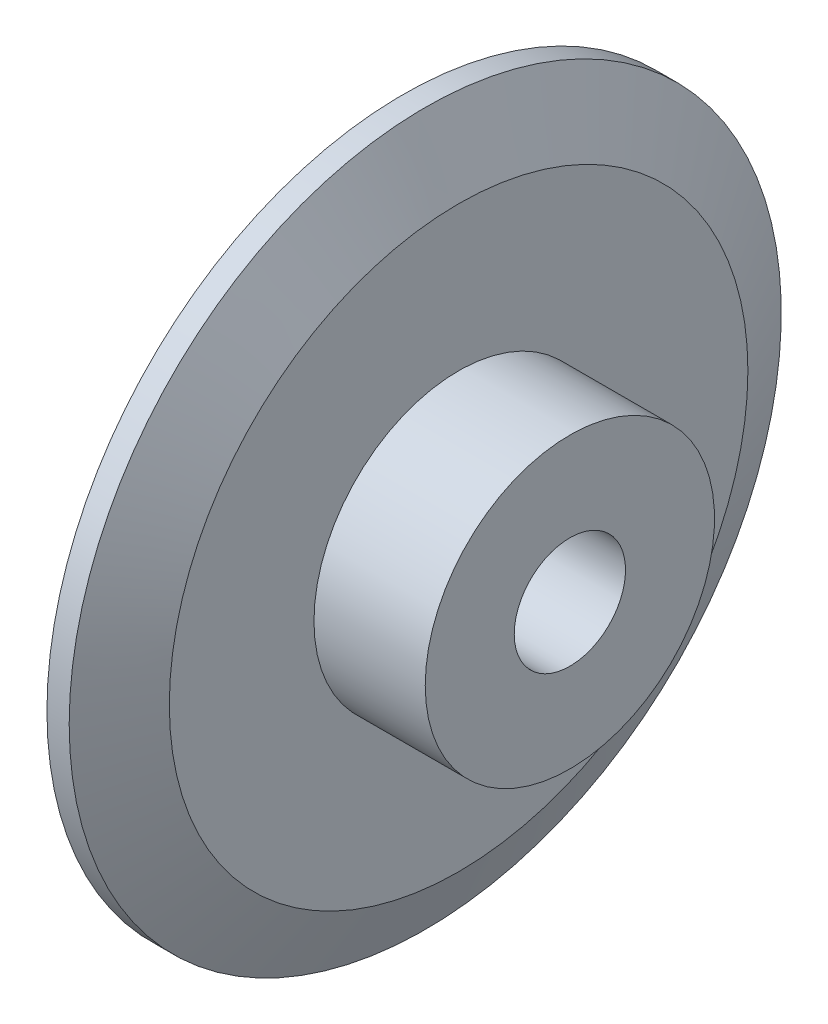
ISO-10303-21;
HEADER;
FILE_DESCRIPTION(('STEP AP214'),'2;1');
FILE_NAME('part.step','',(''),(''),'','','');
FILE_SCHEMA(('AUTOMOTIVE_DESIGN { 1 0 10303 214 1 1 1 1 }'));
ENDSEC;
DATA;
#1=APPLICATION_CONTEXT('core data for automotive mechanical design processes');
#2=APPLICATION_PROTOCOL_DEFINITION('international standard','automotive_design',2000,#1);
#3=PRODUCT_CONTEXT('',#1,'mechanical');
#4=PRODUCT('Part','Part','',(#3));
#5=PRODUCT_RELATED_PRODUCT_CATEGORY('part','',(#4));
#6=PRODUCT_DEFINITION_FORMATION('','',#4);
#7=PRODUCT_DEFINITION_CONTEXT('part definition',#1,'design');
#8=PRODUCT_DEFINITION('design','',#6,#7);
#9=PRODUCT_DEFINITION_SHAPE('','',#8);
#10=(LENGTH_UNIT() NAMED_UNIT(*) SI_UNIT(.MILLI.,.METRE.));
#11=(NAMED_UNIT(*) PLANE_ANGLE_UNIT() SI_UNIT($,.RADIAN.));
#12=(NAMED_UNIT(*) SI_UNIT($,.STERADIAN.) SOLID_ANGLE_UNIT());
#13=UNCERTAINTY_MEASURE_WITH_UNIT(LENGTH_MEASURE(1.E-05),#10,'distance_accuracy_value','');
#14=(GEOMETRIC_REPRESENTATION_CONTEXT(3) GLOBAL_UNCERTAINTY_ASSIGNED_CONTEXT((#13)) GLOBAL_UNIT_ASSIGNED_CONTEXT((#10,
#11,#12)) REPRESENTATION_CONTEXT('',''));
#15=CARTESIAN_POINT('',(0.,0.,0.));
#16=DIRECTION('',(0.,0.,1.));
#17=DIRECTION('',(1.,0.,0.));
#18=AXIS2_PLACEMENT_3D('',#15,#16,#17);
#19=CARTESIAN_POINT('',(-2.,13.,0.));
#20=DIRECTION('',(1.,0.,0.));
#21=DIRECTION('',(0.,0.,-1.));
#22=AXIS2_PLACEMENT_3D('',#19,#20,#21);
#23=PLANE('',#22);
#24=CARTESIAN_POINT('',(-2.,0.,0.));
#25=DIRECTION('',(-1.,0.,0.));
#26=DIRECTION('',(0.,0.,1.));
#27=AXIS2_PLACEMENT_3D('',#24,#25,#26);
#28=CIRCLE('',#27,2.5);
#29=CARTESIAN_POINT('',(-2.,0.,2.5));
#30=VERTEX_POINT('',#29);
#31=EDGE_CURVE('E10',#30,#30,#28,.T.);
#32=ORIENTED_EDGE('',*,*,#31,.F.);
#33=EDGE_LOOP('',(#32));
#34=FACE_BOUND('',#33,.T.);
#35=CARTESIAN_POINT('',(-2.,0.,0.));
#36=DIRECTION('',(-1.,0.,0.));
#37=DIRECTION('',(0.,0.,1.));
#38=AXIS2_PLACEMENT_3D('',#35,#36,#37);
#39=CIRCLE('',#38,13.);
#40=CARTESIAN_POINT('',(-2.,0.,13.));
#41=VERTEX_POINT('',#40);
#42=EDGE_CURVE('E58',#41,#41,#39,.T.);
#43=ORIENTED_EDGE('',*,*,#42,.T.);
#44=EDGE_LOOP('',(#43));
#45=FACE_BOUND('',#44,.T.);
#46=ADVANCED_FACE('F30',(#34,#45),#23,.F.);
#47=CARTESIAN_POINT('',(-14.5300104168178,0.,0.));
#48=DIRECTION('',(-1.,0.,0.));
#49=DIRECTION('',(0.,0.,1.));
#50=AXIS2_PLACEMENT_3D('',#47,#48,#49);
#51=CYLINDRICAL_SURFACE('',#50,2.5);
#52=CARTESIAN_POINT('',(7.,0.,0.));
#53=DIRECTION('',(-1.,0.,0.));
#54=DIRECTION('',(0.,0.,1.));
#55=AXIS2_PLACEMENT_3D('',#52,#53,#54);
#56=CIRCLE('',#55,2.5);
#57=CARTESIAN_POINT('',(7.,0.,2.5));
#58=VERTEX_POINT('',#57);
#59=EDGE_CURVE('E36',#58,#58,#56,.T.);
#60=ORIENTED_EDGE('',*,*,#59,.F.);
#61=EDGE_LOOP('',(#60));
#62=FACE_BOUND('',#61,.T.);
#63=ORIENTED_EDGE('',*,*,#31,.T.);
#64=EDGE_LOOP('',(#63));
#65=FACE_BOUND('',#64,.T.);
#66=ADVANCED_FACE('F95',(#62,#65),#51,.F.);
#67=CARTESIAN_POINT('',(7.,2.5,0.));
#68=DIRECTION('',(-1.,0.,0.));
#69=DIRECTION('',(0.,0.,1.));
#70=AXIS2_PLACEMENT_3D('',#67,#68,#69);
#71=PLANE('',#70);
#72=CARTESIAN_POINT('',(7.,0.,0.));
#73=DIRECTION('',(-1.,0.,0.));
#74=DIRECTION('',(0.,0.,1.));
#75=AXIS2_PLACEMENT_3D('',#72,#73,#74);
#76=CIRCLE('',#75,6.5);
#77=CARTESIAN_POINT('',(7.,0.,6.5));
#78=VERTEX_POINT('',#77);
#79=EDGE_CURVE('E40',#78,#78,#76,.T.);
#80=ORIENTED_EDGE('',*,*,#79,.F.);
#81=EDGE_LOOP('',(#80));
#82=FACE_BOUND('',#81,.T.);
#83=ORIENTED_EDGE('',*,*,#59,.T.);
#84=EDGE_LOOP('',(#83));
#85=FACE_BOUND('',#84,.T.);
#86=ADVANCED_FACE('F90',(#82,#85),#71,.F.);
#87=CARTESIAN_POINT('',(-14.5300104168178,0.,0.));
#88=DIRECTION('',(-1.,0.,0.));
#89=DIRECTION('',(0.,0.,1.));
#90=AXIS2_PLACEMENT_3D('',#87,#88,#89);
#91=CYLINDRICAL_SURFACE('',#90,6.5);
#92=CARTESIAN_POINT('',(2.,0.,0.));
#93=DIRECTION('',(-1.,0.,0.));
#94=DIRECTION('',(0.,0.,1.));
#95=AXIS2_PLACEMENT_3D('',#92,#93,#94);
#96=CIRCLE('',#95,6.5);
#97=CARTESIAN_POINT('',(2.,0.,6.5));
#98=VERTEX_POINT('',#97);
#99=EDGE_CURVE('E44',#98,#98,#96,.T.);
#100=ORIENTED_EDGE('',*,*,#99,.F.);
#101=EDGE_LOOP('',(#100));
#102=FACE_BOUND('',#101,.T.);
#103=ORIENTED_EDGE('',*,*,#79,.T.);
#104=EDGE_LOOP('',(#103));
#105=FACE_BOUND('',#104,.T.);
#106=ADVANCED_FACE('F84',(#102,#105),#91,.T.);
#107=CARTESIAN_POINT('',(2.,6.5,0.));
#108=DIRECTION('',(-1.,0.,0.));
#109=DIRECTION('',(0.,0.,1.));
#110=AXIS2_PLACEMENT_3D('',#107,#108,#109);
#111=PLANE('',#110);
#112=CARTESIAN_POINT('',(2.,0.,0.));
#113=DIRECTION('',(-1.,0.,0.));
#114=DIRECTION('',(0.,0.,1.));
#115=AXIS2_PLACEMENT_3D('',#112,#113,#114);
#116=CIRCLE('',#115,13.);
#117=CARTESIAN_POINT('',(2.,0.,13.));
#118=VERTEX_POINT('',#117);
#119=EDGE_CURVE('E49',#118,#118,#116,.T.);
#120=ORIENTED_EDGE('',*,*,#119,.F.);
#121=EDGE_LOOP('',(#120));
#122=FACE_BOUND('',#121,.T.);
#123=ORIENTED_EDGE('',*,*,#99,.T.);
#124=EDGE_LOOP('',(#123));
#125=FACE_BOUND('',#124,.T.);
#126=ADVANCED_FACE('F78',(#122,#125),#111,.F.);
#127=CARTESIAN_POINT('',(2.,0.,0.));
#128=DIRECTION('',(-1.,0.,0.));
#129=DIRECTION('',(0.,0.,1.));
#130=AXIS2_PLACEMENT_3D('',#127,#128,#129);
#131=CONICAL_SURFACE('',#130,13.,1.10714871779409);
#132=CARTESIAN_POINT('',(0.5,0.,0.));
#133=DIRECTION('',(-1.,0.,0.));
#134=DIRECTION('',(0.,0.,1.));
#135=AXIS2_PLACEMENT_3D('',#132,#133,#134);
#136=CIRCLE('',#135,16.);
#137=CARTESIAN_POINT('',(0.5,0.,16.));
#138=VERTEX_POINT('',#137);
#139=EDGE_CURVE('E52',#138,#138,#136,.T.);
#140=ORIENTED_EDGE('',*,*,#139,.F.);
#141=EDGE_LOOP('',(#140));
#142=FACE_BOUND('',#141,.T.);
#143=ORIENTED_EDGE('',*,*,#119,.T.);
#144=EDGE_LOOP('',(#143));
#145=FACE_BOUND('',#144,.T.);
#146=ADVANCED_FACE('F72',(#142,#145),#131,.T.);
#147=CARTESIAN_POINT('',(-14.5300104168178,0.,0.));
#148=DIRECTION('',(-1.,0.,0.));
#149=DIRECTION('',(0.,0.,1.));
#150=AXIS2_PLACEMENT_3D('',#147,#148,#149);
#151=CYLINDRICAL_SURFACE('',#150,16.);
#152=CARTESIAN_POINT('',(-0.5,0.,0.));
#153=DIRECTION('',(-1.,0.,0.));
#154=DIRECTION('',(0.,0.,1.));
#155=AXIS2_PLACEMENT_3D('',#152,#153,#154);
#156=CIRCLE('',#155,16.);
#157=CARTESIAN_POINT('',(-0.5,0.,16.));
#158=VERTEX_POINT('',#157);
#159=EDGE_CURVE('E55',#158,#158,#156,.T.);
#160=ORIENTED_EDGE('',*,*,#159,.F.);
#161=EDGE_LOOP('',(#160));
#162=FACE_BOUND('',#161,.T.);
#163=ORIENTED_EDGE('',*,*,#139,.T.);
#164=EDGE_LOOP('',(#163));
#165=FACE_BOUND('',#164,.T.);
#166=ADVANCED_FACE('F66',(#162,#165),#151,.T.);
#167=CARTESIAN_POINT('',(-0.5,0.,0.));
#168=DIRECTION('',(1.,0.,0.));
#169=DIRECTION('',(0.,0.,-1.));
#170=AXIS2_PLACEMENT_3D('',#167,#168,#169);
#171=CONICAL_SURFACE('',#170,16.,1.10714871779409);
#172=ORIENTED_EDGE('',*,*,#42,.F.);
#173=EDGE_LOOP('',(#172));
#174=FACE_BOUND('',#173,.T.);
#175=ORIENTED_EDGE('',*,*,#159,.T.);
#176=EDGE_LOOP('',(#175));
#177=FACE_BOUND('',#176,.T.);
#178=ADVANCED_FACE('F63',(#174,#177),#171,.T.);
#179=CLOSED_SHELL('',(#46,#66,#86,#106,#126,#146,#166,#178));
#180=MANIFOLD_SOLID_BREP('B2',#179);
#181=ADVANCED_BREP_SHAPE_REPRESENTATION('',(#18,#180),#14);
#182=SHAPE_DEFINITION_REPRESENTATION(#9,#181);
ENDSEC;
END-ISO-10303-21;
